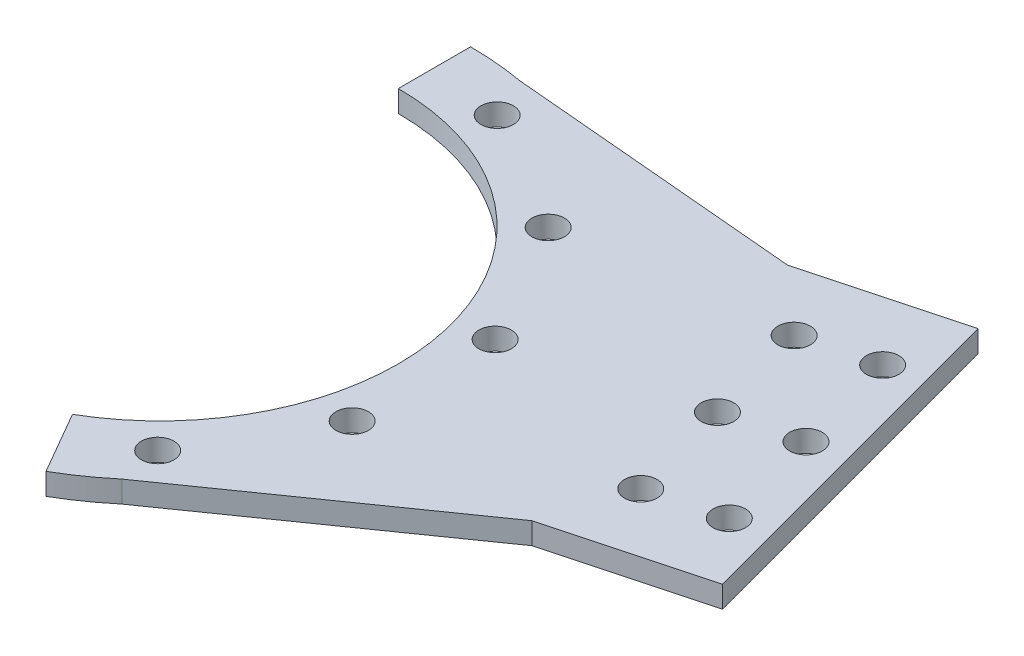
ISO-10303-21;
HEADER;
FILE_DESCRIPTION(('STEP AP214'),'2;1');
FILE_NAME('part.step','',(''),(''),'','','');
FILE_SCHEMA(('AUTOMOTIVE_DESIGN { 1 0 10303 214 1 1 1 1 }'));
ENDSEC;
DATA;
#1=APPLICATION_CONTEXT('core data for automotive mechanical design processes');
#2=APPLICATION_PROTOCOL_DEFINITION('international standard','automotive_design',2000,#1);
#3=PRODUCT_CONTEXT('',#1,'mechanical');
#4=PRODUCT('Part','Part','',(#3));
#5=PRODUCT_RELATED_PRODUCT_CATEGORY('part','',(#4));
#6=PRODUCT_DEFINITION_FORMATION('','',#4);
#7=PRODUCT_DEFINITION_CONTEXT('part definition',#1,'design');
#8=PRODUCT_DEFINITION('design','',#6,#7);
#9=PRODUCT_DEFINITION_SHAPE('','',#8);
#10=(LENGTH_UNIT() NAMED_UNIT(*) SI_UNIT(.MILLI.,.METRE.));
#11=(NAMED_UNIT(*) PLANE_ANGLE_UNIT() SI_UNIT($,.RADIAN.));
#12=(NAMED_UNIT(*) SI_UNIT($,.STERADIAN.) SOLID_ANGLE_UNIT());
#13=UNCERTAINTY_MEASURE_WITH_UNIT(LENGTH_MEASURE(1.E-05),#10,'distance_accuracy_value','');
#14=(GEOMETRIC_REPRESENTATION_CONTEXT(3) GLOBAL_UNCERTAINTY_ASSIGNED_CONTEXT((#13)) GLOBAL_UNIT_ASSIGNED_CONTEXT((#10,
#11,#12)) REPRESENTATION_CONTEXT('',''));
#15=CARTESIAN_POINT('',(0.,0.,0.));
#16=DIRECTION('',(0.,0.,1.));
#17=DIRECTION('',(1.,0.,0.));
#18=AXIS2_PLACEMENT_3D('',#15,#16,#17);
#19=CARTESIAN_POINT('',(0.,1.5,0.));
#20=DIRECTION('',(0.,-1.,0.));
#21=DIRECTION('',(0.,0.,-1.));
#22=AXIS2_PLACEMENT_3D('',#19,#20,#21);
#23=CYLINDRICAL_SURFACE('',#22,43.);
#24=DIRECTION('',(0.,-1.,0.));
#25=VECTOR('',#24,1.);
#26=CARTESIAN_POINT('',(27.67036701415,1.5,32.9142946043545));
#27=LINE('',#26,#25);
#28=CARTESIAN_POINT('',(27.6703670141498,1.5,32.9142946043546));
#29=VERTEX_POINT('',#28);
#30=CARTESIAN_POINT('',(27.6703670141498,-1.5,32.9142946043546));
#31=VERTEX_POINT('',#30);
#32=EDGE_CURVE('E47',#29,#31,#27,.T.);
#33=ORIENTED_EDGE('',*,*,#32,.F.);
#34=CARTESIAN_POINT('',(0.,1.5,0.));
#35=DIRECTION('',(0.,1.,0.));
#36=DIRECTION('',(0.,0.,-1.));
#37=AXIS2_PLACEMENT_3D('',#34,#35,#36);
#38=CIRCLE('',#37,43.);
#39=CARTESIAN_POINT('',(21.4999999999998,1.5,37.239092362731));
#40=VERTEX_POINT('',#39);
#41=EDGE_CURVE('E166',#40,#29,#38,.T.);
#42=ORIENTED_EDGE('',*,*,#41,.F.);
#43=DIRECTION('',(0.,-1.,0.));
#44=VECTOR('',#43,1.);
#45=CARTESIAN_POINT('',(21.4999999999998,1.5,37.239092362731));
#46=LINE('',#45,#44);
#47=CARTESIAN_POINT('',(21.4999999999998,-1.5,37.239092362731));
#48=VERTEX_POINT('',#47);
#49=EDGE_CURVE('E175',#40,#48,#46,.T.);
#50=ORIENTED_EDGE('',*,*,#49,.T.);
#51=CARTESIAN_POINT('',(0.,-1.5,0.));
#52=DIRECTION('',(0.,1.,0.));
#53=DIRECTION('',(0.,0.,-1.));
#54=AXIS2_PLACEMENT_3D('',#51,#52,#53);
#55=CIRCLE('',#54,43.);
#56=EDGE_CURVE('E52',#48,#31,#55,.T.);
#57=ORIENTED_EDGE('',*,*,#56,.T.);
#58=EDGE_LOOP('',(#33,#42,#50,#57));
#59=FACE_BOUND('',#58,.T.);
#60=ADVANCED_FACE('F32',(#59),#23,.T.);
#61=CARTESIAN_POINT('',(81.8126905781105,1.5,3.96026013922945));
#62=DIRECTION('',(-0.258819045102535,0.,-0.965925826289064));
#63=DIRECTION('',(-0.965925826289065,0.,0.258819045102535));
#64=AXIS2_PLACEMENT_3D('',#61,#62,#63);
#65=PLANE('',#64);
#66=DIRECTION('',(0.,-1.,0.));
#67=VECTOR('',#66,1.);
#68=CARTESIAN_POINT('',(61.0383844340775,1.5,9.52671869384002));
#69=LINE('',#68,#67);
#70=CARTESIAN_POINT('',(61.0383844340775,1.5,9.52671869384034));
#71=VERTEX_POINT('',#70);
#72=CARTESIAN_POINT('',(61.0383844340775,-1.5,9.52671869384002));
#73=VERTEX_POINT('',#72);
#74=EDGE_CURVE('E123',#71,#73,#69,.T.);
#75=ORIENTED_EDGE('',*,*,#74,.T.);
#76=DIRECTION('',(0.965925826289065,0.,-0.258819045102535));
#77=VECTOR('',#76,1.);
#78=CARTESIAN_POINT('',(81.8126905781105,-1.5,3.96026013922945));
#79=LINE('',#78,#77);
#80=CARTESIAN_POINT('',(81.8126905781105,-1.5,3.96026013922945));
#81=VERTEX_POINT('',#80);
#82=EDGE_CURVE('E109',#73,#81,#79,.T.);
#83=ORIENTED_EDGE('',*,*,#82,.T.);
#84=DIRECTION('',(0.,-1.,0.));
#85=VECTOR('',#84,1.);
#86=CARTESIAN_POINT('',(81.8126905781105,1.5,3.96026013922945));
#87=LINE('',#86,#85);
#88=CARTESIAN_POINT('',(81.8126905781105,1.5,3.96026013922945));
#89=VERTEX_POINT('',#88);
#90=EDGE_CURVE('E158',#89,#81,#87,.T.);
#91=ORIENTED_EDGE('',*,*,#90,.F.);
#92=DIRECTION('',(0.965925826289065,0.,-0.258819045102535));
#93=VECTOR('',#92,1.);
#94=CARTESIAN_POINT('',(81.8126905781105,1.5,3.96026013922945));
#95=LINE('',#94,#93);
#96=EDGE_CURVE('E125',#71,#89,#95,.T.);
#97=ORIENTED_EDGE('',*,*,#96,.F.);
#98=EDGE_LOOP('',(#75,#83,#91,#97));
#99=FACE_BOUND('',#98,.T.);
#100=ADVANCED_FACE('F124',(#99),#65,.F.);
#101=DIRECTION('',(0.,-1.,0.));
#102=VECTOR('',#101,1.);
#103=CARTESIAN_POINT('',(7.50609346411504,1.5,-42.3397987820912));
#104=LINE('',#103,#102);
#105=CARTESIAN_POINT('',(7.50609346411481,-1.5,-42.3397987820912));
#106=VERTEX_POINT('',#105);
#107=CARTESIAN_POINT('',(7.50609346411481,1.5,-42.3397987820912));
#108=VERTEX_POINT('',#107);
#109=EDGE_CURVE('E149',#106,#108,#104,.F.);
#110=ORIENTED_EDGE('',*,*,#109,.F.);
#111=CARTESIAN_POINT('',(0.,-1.5,-43.));
#112=VERTEX_POINT('',#111);
#113=EDGE_CURVE('E165',#106,#112,#55,.T.);
#114=ORIENTED_EDGE('',*,*,#113,.T.);
#115=DIRECTION('',(0.,-1.,0.));
#116=VECTOR('',#115,1.);
#117=CARTESIAN_POINT('',(0.,1.5,-43.));
#118=LINE('',#117,#116);
#119=CARTESIAN_POINT('',(0.,1.5,-43.));
#120=VERTEX_POINT('',#119);
#121=EDGE_CURVE('E11',#120,#112,#118,.T.);
#122=ORIENTED_EDGE('',*,*,#121,.F.);
#123=EDGE_CURVE('E169',#108,#120,#38,.T.);
#124=ORIENTED_EDGE('',*,*,#123,.F.);
#125=EDGE_LOOP('',(#110,#114,#122,#124));
#126=FACE_BOUND('',#125,.T.);
#127=ADVANCED_FACE('F34',(#126),#23,.T.);
#128=CARTESIAN_POINT('',(68.8717383229838,1.5,-44.3360311752238));
#129=DIRECTION('',(0.258819045102535,0.,0.965925826289064));
#130=DIRECTION('',(0.965925826289065,0.,-0.258819045102535));
#131=AXIS2_PLACEMENT_3D('',#128,#129,#130);
#132=PLANE('',#131);
#133=DIRECTION('',(0.,-1.,0.));
#134=VECTOR('',#133,1.);
#135=CARTESIAN_POINT('',(48.0974321789512,1.5,-38.769572620613));
#136=LINE('',#135,#134);
#137=CARTESIAN_POINT('',(48.0974321789512,1.5,-38.769572620613));
#138=VERTEX_POINT('',#137);
#139=CARTESIAN_POINT('',(48.0974321789512,-1.5,-38.769572620613));
#140=VERTEX_POINT('',#139);
#141=EDGE_CURVE('E144',#138,#140,#136,.T.);
#142=ORIENTED_EDGE('',*,*,#141,.F.);
#143=DIRECTION('',(-0.965925826289065,0.,0.258819045102535));
#144=VECTOR('',#143,1.);
#145=CARTESIAN_POINT('',(68.8717383229838,1.5,-44.3360311752238));
#146=LINE('',#145,#144);
#147=CARTESIAN_POINT('',(68.8717383229838,1.5,-44.3360311752238));
#148=VERTEX_POINT('',#147);
#149=EDGE_CURVE('E154',#148,#138,#146,.T.);
#150=ORIENTED_EDGE('',*,*,#149,.F.);
#151=DIRECTION('',(0.,-1.,0.));
#152=VECTOR('',#151,1.);
#153=CARTESIAN_POINT('',(68.8717383229838,1.5,-44.3360311752238));
#154=LINE('',#153,#152);
#155=CARTESIAN_POINT('',(68.8717383229838,-1.5,-44.3360311752238));
#156=VERTEX_POINT('',#155);
#157=EDGE_CURVE('E162',#148,#156,#154,.T.);
#158=ORIENTED_EDGE('',*,*,#157,.T.);
#159=DIRECTION('',(-0.965925826289065,0.,0.258819045102535));
#160=VECTOR('',#159,1.);
#161=CARTESIAN_POINT('',(68.8717383229838,-1.5,-44.3360311752238));
#162=LINE('',#161,#160);
#163=EDGE_CURVE('E120',#156,#140,#162,.T.);
#164=ORIENTED_EDGE('',*,*,#163,.T.);
#165=EDGE_LOOP('',(#142,#150,#158,#164));
#166=FACE_BOUND('',#165,.T.);
#167=ADVANCED_FACE('F212',(#166),#132,.F.);
#168=CARTESIAN_POINT('',(0.,1.5,-33.));
#169=DIRECTION('',(1.,0.,0.));
#170=DIRECTION('',(0.,0.,-1.));
#171=AXIS2_PLACEMENT_3D('',#168,#169,#170);
#172=PLANE('',#171);
#173=DIRECTION('',(0.,0.,1.));
#174=VECTOR('',#173,1.);
#175=CARTESIAN_POINT('',(0.,-1.5,-33.));
#176=LINE('',#175,#174);
#177=CARTESIAN_POINT('',(0.,-1.5,-33.));
#178=VERTEX_POINT('',#177);
#179=EDGE_CURVE('E177',#112,#178,#176,.T.);
#180=ORIENTED_EDGE('',*,*,#179,.T.);
#181=DIRECTION('',(0.,-1.,0.));
#182=VECTOR('',#181,1.);
#183=CARTESIAN_POINT('',(0.,1.5,-33.));
#184=LINE('',#183,#182);
#185=CARTESIAN_POINT('',(0.,1.5,-33.));
#186=VERTEX_POINT('',#185);
#187=EDGE_CURVE('E40',#186,#178,#184,.T.);
#188=ORIENTED_EDGE('',*,*,#187,.F.);
#189=DIRECTION('',(0.,0.,1.));
#190=VECTOR('',#189,1.);
#191=CARTESIAN_POINT('',(0.,1.5,-33.));
#192=LINE('',#191,#190);
#193=EDGE_CURVE('E168',#120,#186,#192,.T.);
#194=ORIENTED_EDGE('',*,*,#193,.F.);
#195=ORIENTED_EDGE('',*,*,#121,.T.);
#196=EDGE_LOOP('',(#180,#188,#194,#195));
#197=FACE_BOUND('',#196,.T.);
#198=ADVANCED_FACE('F205',(#197),#172,.F.);
#199=CARTESIAN_POINT('',(0.,1.5,0.));
#200=DIRECTION('',(0.,-1.,0.));
#201=DIRECTION('',(0.,0.,-1.));
#202=AXIS2_PLACEMENT_3D('',#199,#200,#201);
#203=CYLINDRICAL_SURFACE('',#202,33.);
#204=CARTESIAN_POINT('',(0.,-1.5,0.));
#205=DIRECTION('',(0.,-1.,0.));
#206=DIRECTION('',(0.,0.,-1.));
#207=AXIS2_PLACEMENT_3D('',#204,#205,#206);
#208=CIRCLE('',#207,33.);
#209=CARTESIAN_POINT('',(16.4999999999998,-1.5,28.5788383248866));
#210=VERTEX_POINT('',#209);
#211=EDGE_CURVE('E179',#178,#210,#208,.T.);
#212=ORIENTED_EDGE('',*,*,#211,.T.);
#213=DIRECTION('',(0.,-1.,0.));
#214=VECTOR('',#213,1.);
#215=CARTESIAN_POINT('',(16.4999999999998,1.5,28.5788383248866));
#216=LINE('',#215,#214);
#217=CARTESIAN_POINT('',(16.4999999999998,1.5,28.5788383248866));
#218=VERTEX_POINT('',#217);
#219=EDGE_CURVE('E184',#218,#210,#216,.T.);
#220=ORIENTED_EDGE('',*,*,#219,.F.);
#221=CARTESIAN_POINT('',(0.,1.5,0.));
#222=DIRECTION('',(0.,-1.,0.));
#223=DIRECTION('',(0.,0.,-1.));
#224=AXIS2_PLACEMENT_3D('',#221,#222,#223);
#225=CIRCLE('',#224,33.);
#226=EDGE_CURVE('E171',#186,#218,#225,.T.);
#227=ORIENTED_EDGE('',*,*,#226,.F.);
#228=ORIENTED_EDGE('',*,*,#187,.T.);
#229=EDGE_LOOP('',(#212,#220,#227,#228));
#230=FACE_BOUND('',#229,.T.);
#231=ADVANCED_FACE('F191',(#230),#203,.F.);
#232=CARTESIAN_POINT('',(16.4999999999998,1.5,28.5788383248866));
#233=DIRECTION('',(0.866025403784441,0.,-0.499999999999995));
#234=DIRECTION('',(-0.499999999999995,0.,-0.866025403784441));
#235=AXIS2_PLACEMENT_3D('',#232,#233,#234);
#236=PLANE('',#235);
#237=DIRECTION('',(0.499999999999995,0.,0.866025403784441));
#238=VECTOR('',#237,1.);
#239=CARTESIAN_POINT('',(16.4999999999998,-1.5,28.5788383248866));
#240=LINE('',#239,#238);
#241=EDGE_CURVE('E181',#210,#48,#240,.T.);
#242=ORIENTED_EDGE('',*,*,#241,.T.);
#243=ORIENTED_EDGE('',*,*,#49,.F.);
#244=DIRECTION('',(0.499999999999995,0.,0.866025403784441));
#245=VECTOR('',#244,1.);
#246=CARTESIAN_POINT('',(16.4999999999998,1.5,28.5788383248866));
#247=LINE('',#246,#245);
#248=EDGE_CURVE('E173',#218,#40,#247,.T.);
#249=ORIENTED_EDGE('',*,*,#248,.F.);
#250=ORIENTED_EDGE('',*,*,#219,.T.);
#251=EDGE_LOOP('',(#242,#243,#249,#250));
#252=FACE_BOUND('',#251,.T.);
#253=ADVANCED_FACE('F200',(#252),#236,.F.);
#254=CARTESIAN_POINT('',(0.,1.5,0.));
#255=DIRECTION('',(0.,-1.,0.));
#256=DIRECTION('',(0.,0.,-1.));
#257=AXIS2_PLACEMENT_3D('',#254,#255,#256);
#258=PLANE('',#257);
#259=CARTESIAN_POINT('',(74.3948709956399,1.5,-4.40490289814852));
#260=DIRECTION('',(0.,-1.,0.));
#261=DIRECTION('',(0.,0.,-1.));
#262=AXIS2_PLACEMENT_3D('',#259,#260,#261);
#263=CIRCLE('',#262,2.25);
#264=CARTESIAN_POINT('',(74.3948709956399,1.5,-6.65490289814852));
#265=VERTEX_POINT('',#264);
#266=EDGE_CURVE('E294',#265,#265,#263,.T.);
#267=ORIENTED_EDGE('',*,*,#266,.T.);
#268=EDGE_LOOP('',(#267));
#269=FACE_BOUND('',#268,.T.);
#270=CARTESIAN_POINT('',(64.7356127327492,1.5,-1.81671244712317));
#271=DIRECTION('',(0.,-1.,0.));
#272=DIRECTION('',(0.,0.,-1.));
#273=AXIS2_PLACEMENT_3D('',#270,#271,#272);
#274=CIRCLE('',#273,2.25);
#275=CARTESIAN_POINT('',(64.7356127327492,1.5,-4.06671244712317));
#276=VERTEX_POINT('',#275);
#277=EDGE_CURVE('E297',#276,#276,#274,.T.);
#278=ORIENTED_EDGE('',*,*,#277,.T.);
#279=EDGE_LOOP('',(#278));
#280=FACE_BOUND('',#279,.T.);
#281=CARTESIAN_POINT('',(60.8533270562112,1.5,-16.3055998414591));
#282=DIRECTION('',(0.,-1.,0.));
#283=DIRECTION('',(0.,0.,-1.));
#284=AXIS2_PLACEMENT_3D('',#281,#282,#283);
#285=CIRCLE('',#284,2.25);
#286=CARTESIAN_POINT('',(60.8533270562112,1.5,-18.5555998414591));
#287=VERTEX_POINT('',#286);
#288=EDGE_CURVE('E317',#287,#287,#285,.T.);
#289=ORIENTED_EDGE('',*,*,#288,.T.);
#290=EDGE_LOOP('',(#289));
#291=FACE_BOUND('',#290,.T.);
#292=CARTESIAN_POINT('',(66.6302996425638,1.5,-33.3826776868205));
#293=DIRECTION('',(0.,-1.,0.));
#294=DIRECTION('',(0.,0.,-1.));
#295=AXIS2_PLACEMENT_3D('',#292,#293,#294);
#296=CIRCLE('',#295,2.25);
#297=CARTESIAN_POINT('',(66.6302996425638,1.5,-35.6326776868205));
#298=VERTEX_POINT('',#297);
#299=EDGE_CURVE('E314',#298,#298,#296,.T.);
#300=ORIENTED_EDGE('',*,*,#299,.T.);
#301=EDGE_LOOP('',(#300));
#302=FACE_BOUND('',#301,.T.);
#303=CARTESIAN_POINT('',(56.9710413796732,1.5,-30.7944872357951));
#304=DIRECTION('',(0.,-1.,0.));
#305=DIRECTION('',(0.,0.,-1.));
#306=AXIS2_PLACEMENT_3D('',#303,#304,#305);
#307=CIRCLE('',#306,2.25);
#308=CARTESIAN_POINT('',(56.9710413796732,1.5,-33.0444872357951));
#309=VERTEX_POINT('',#308);
#310=EDGE_CURVE('E309',#309,#309,#307,.T.);
#311=ORIENTED_EDGE('',*,*,#310,.T.);
#312=EDGE_LOOP('',(#311));
#313=FACE_BOUND('',#312,.T.);
#314=CARTESIAN_POINT('',(70.5125853191018,1.5,-18.8937902924845));
#315=DIRECTION('',(0.,-1.,0.));
#316=DIRECTION('',(0.,0.,-1.));
#317=AXIS2_PLACEMENT_3D('',#314,#315,#316);
#318=CIRCLE('',#317,2.25);
#319=CARTESIAN_POINT('',(70.5125853191018,1.5,-21.1437902924845));
#320=VERTEX_POINT('',#319);
#321=EDGE_CURVE('E323',#320,#320,#318,.T.);
#322=ORIENTED_EDGE('',*,*,#321,.T.);
#323=EDGE_LOOP('',(#322));
#324=FACE_BOUND('',#323,.T.);
#325=CARTESIAN_POINT('',(36.6520508829246,1.5,10.0313092901925));
#326=DIRECTION('',(0.,-1.,0.));
#327=DIRECTION('',(0.,0.,-1.));
#328=AXIS2_PLACEMENT_3D('',#325,#326,#327);
#329=CIRCLE('',#328,2.25);
#330=CARTESIAN_POINT('',(36.6520508829246,1.5,7.78130929019255));
#331=VERTEX_POINT('',#330);
#332=EDGE_CURVE('E347',#331,#331,#329,.T.);
#333=ORIENTED_EDGE('',*,*,#332,.T.);
#334=EDGE_LOOP('',(#333));
#335=FACE_BOUND('',#334,.T.);
#336=CARTESIAN_POINT('',(26.7259525203163,1.5,27.0133941199879));
#337=DIRECTION('',(0.,-1.,0.));
#338=DIRECTION('',(0.,0.,-1.));
#339=AXIS2_PLACEMENT_3D('',#336,#337,#338);
#340=CIRCLE('',#339,2.25);
#341=CARTESIAN_POINT('',(26.7259525203163,1.5,24.7633941199879));
#342=VERTEX_POINT('',#341);
#343=EDGE_CURVE('E344',#342,#342,#340,.T.);
#344=ORIENTED_EDGE('',*,*,#343,.T.);
#345=EDGE_LOOP('',(#344));
#346=FACE_BOUND('',#345,.T.);
#347=CARTESIAN_POINT('',(27.0133941199878,1.5,-26.7259525203164));
#348=DIRECTION('',(0.,-1.,0.));
#349=DIRECTION('',(0.,0.,-1.));
#350=AXIS2_PLACEMENT_3D('',#347,#348,#349);
#351=CIRCLE('',#350,2.25);
#352=CARTESIAN_POINT('',(27.0133941199878,1.5,-28.9759525203164));
#353=VERTEX_POINT('',#352);
#354=EDGE_CURVE('E341',#353,#353,#351,.T.);
#355=ORIENTED_EDGE('',*,*,#354,.T.);
#356=EDGE_LOOP('',(#355));
#357=FACE_BOUND('',#356,.T.);
#358=CARTESIAN_POINT('',(10.0313092901924,1.5,-36.6520508829247));
#359=DIRECTION('',(0.,-1.,0.));
#360=DIRECTION('',(0.,0.,-1.));
#361=AXIS2_PLACEMENT_3D('',#358,#359,#360);
#362=CIRCLE('',#361,2.25);
#363=CARTESIAN_POINT('',(10.0313092901924,1.5,-38.9020508829247));
#364=VERTEX_POINT('',#363);
#365=EDGE_CURVE('E330',#364,#364,#362,.T.);
#366=ORIENTED_EDGE('',*,*,#365,.T.);
#367=EDGE_LOOP('',(#366));
#368=FACE_BOUND('',#367,.T.);
#369=CARTESIAN_POINT('',(36.7572618105089,1.5,-9.63865676293677));
#370=DIRECTION('',(0.,-1.,0.));
#371=DIRECTION('',(0.,0.,-1.));
#372=AXIS2_PLACEMENT_3D('',#369,#370,#371);
#373=CIRCLE('',#372,2.25);
#374=CARTESIAN_POINT('',(36.7572618105089,1.5,-11.8886567629368));
#375=VERTEX_POINT('',#374);
#376=EDGE_CURVE('E132',#375,#375,#373,.T.);
#377=ORIENTED_EDGE('',*,*,#376,.T.);
#378=EDGE_LOOP('',(#377));
#379=FACE_BOUND('',#378,.T.);
#380=ORIENTED_EDGE('',*,*,#41,.T.);
#381=DIRECTION('',(0.818886309568862,0.,-0.573955757877461));
#382=VECTOR('',#381,1.);
#383=CARTESIAN_POINT('',(21.5000000000005,1.5,37.2390923627306));
#384=LINE('',#383,#382);
#385=EDGE_CURVE('E129',#29,#71,#384,.T.);
#386=ORIENTED_EDGE('',*,*,#385,.T.);
#387=ORIENTED_EDGE('',*,*,#96,.T.);
#388=DIRECTION('',(-0.258819045102534,0.,-0.965925826289065));
#389=VECTOR('',#388,1.);
#390=CARTESIAN_POINT('',(68.8717383229838,1.5,-44.3360311752238));
#391=LINE('',#390,#389);
#392=EDGE_CURVE('E119',#89,#148,#391,.T.);
#393=ORIENTED_EDGE('',*,*,#392,.T.);
#394=ORIENTED_EDGE('',*,*,#149,.T.);
#395=DIRECTION('',(-0.996154225836654,0.,-0.0876171121857866));
#396=VECTOR('',#395,1.);
#397=CARTESIAN_POINT('',(0.,1.5,-43.));
#398=LINE('',#397,#396);
#399=EDGE_CURVE('E141',#138,#108,#398,.T.);
#400=ORIENTED_EDGE('',*,*,#399,.T.);
#401=ORIENTED_EDGE('',*,*,#123,.T.);
#402=ORIENTED_EDGE('',*,*,#193,.T.);
#403=ORIENTED_EDGE('',*,*,#226,.T.);
#404=ORIENTED_EDGE('',*,*,#248,.T.);
#405=EDGE_LOOP('',(#380,#386,#387,#393,#394,#400,#401,#402,#403,#404));
#406=FACE_BOUND('',#405,.T.);
#407=ADVANCED_FACE('F203',(#269,#280,#291,#302,#313,#324,#335,#346,#357,#368,#379,#406),#258,.F.);
#408=CARTESIAN_POINT('',(0.,-1.5,0.));
#409=DIRECTION('',(0.,-1.,0.));
#410=DIRECTION('',(0.,0.,-1.));
#411=AXIS2_PLACEMENT_3D('',#408,#409,#410);
#412=PLANE('',#411);
#413=CARTESIAN_POINT('',(74.3948709956399,-1.5,-4.40490289814852));
#414=DIRECTION('',(0.,1.,0.));
#415=DIRECTION('',(0.,0.,1.));
#416=AXIS2_PLACEMENT_3D('',#413,#414,#415);
#417=CIRCLE('',#416,2.25);
#418=CARTESIAN_POINT('',(74.3948709956399,-1.5,-2.15490289814853));
#419=VERTEX_POINT('',#418);
#420=EDGE_CURVE('E291',#419,#419,#417,.T.);
#421=ORIENTED_EDGE('',*,*,#420,.T.);
#422=EDGE_LOOP('',(#421));
#423=FACE_BOUND('',#422,.T.);
#424=CARTESIAN_POINT('',(64.7356127327492,-1.5,-1.81671244712317));
#425=DIRECTION('',(0.,1.,0.));
#426=DIRECTION('',(0.,0.,1.));
#427=AXIS2_PLACEMENT_3D('',#424,#425,#426);
#428=CIRCLE('',#427,2.25);
#429=CARTESIAN_POINT('',(64.7356127327492,-1.5,0.433287552876823));
#430=VERTEX_POINT('',#429);
#431=EDGE_CURVE('E550',#430,#430,#428,.T.);
#432=ORIENTED_EDGE('',*,*,#431,.T.);
#433=EDGE_LOOP('',(#432));
#434=FACE_BOUND('',#433,.T.);
#435=CARTESIAN_POINT('',(60.8533270562112,-1.5,-16.3055998414591));
#436=DIRECTION('',(0.,1.,0.));
#437=DIRECTION('',(0.,0.,1.));
#438=AXIS2_PLACEMENT_3D('',#435,#436,#437);
#439=CIRCLE('',#438,2.25);
#440=CARTESIAN_POINT('',(60.8533270562112,-1.5,-14.0555998414591));
#441=VERTEX_POINT('',#440);
#442=EDGE_CURVE('E306',#441,#441,#439,.T.);
#443=ORIENTED_EDGE('',*,*,#442,.T.);
#444=EDGE_LOOP('',(#443));
#445=FACE_BOUND('',#444,.T.);
#446=CARTESIAN_POINT('',(66.6302996425638,-1.5,-33.3826776868205));
#447=DIRECTION('',(0.,1.,0.));
#448=DIRECTION('',(0.,0.,1.));
#449=AXIS2_PLACEMENT_3D('',#446,#447,#448);
#450=CIRCLE('',#449,2.25);
#451=CARTESIAN_POINT('',(66.6302996425638,-1.5,-31.1326776868205));
#452=VERTEX_POINT('',#451);
#453=EDGE_CURVE('E300',#452,#452,#450,.T.);
#454=ORIENTED_EDGE('',*,*,#453,.T.);
#455=EDGE_LOOP('',(#454));
#456=FACE_BOUND('',#455,.T.);
#457=CARTESIAN_POINT('',(56.9710413796732,-1.5,-30.7944872357951));
#458=DIRECTION('',(0.,1.,0.));
#459=DIRECTION('',(0.,0.,1.));
#460=AXIS2_PLACEMENT_3D('',#457,#458,#459);
#461=CIRCLE('',#460,2.25);
#462=CARTESIAN_POINT('',(56.9710413796732,-1.5,-28.5444872357951));
#463=VERTEX_POINT('',#462);
#464=EDGE_CURVE('E296',#463,#463,#461,.T.);
#465=ORIENTED_EDGE('',*,*,#464,.T.);
#466=EDGE_LOOP('',(#465));
#467=FACE_BOUND('',#466,.T.);
#468=CARTESIAN_POINT('',(70.5125853191018,-1.5,-18.8937902924845));
#469=DIRECTION('',(0.,1.,0.));
#470=DIRECTION('',(0.,0.,1.));
#471=AXIS2_PLACEMENT_3D('',#468,#469,#470);
#472=CIRCLE('',#471,2.25);
#473=CARTESIAN_POINT('',(70.5125853191018,-1.5,-16.6437902924845));
#474=VERTEX_POINT('',#473);
#475=EDGE_CURVE('E320',#474,#474,#472,.T.);
#476=ORIENTED_EDGE('',*,*,#475,.T.);
#477=EDGE_LOOP('',(#476));
#478=FACE_BOUND('',#477,.T.);
#479=CARTESIAN_POINT('',(36.6520508829246,-1.5,10.0313092901925));
#480=DIRECTION('',(0.,1.,0.));
#481=DIRECTION('',(-0.500000000000001,0.,0.866025403784438));
#482=AXIS2_PLACEMENT_3D('',#479,#480,#481);
#483=CIRCLE('',#482,2.25);
#484=CARTESIAN_POINT('',(35.5270508829246,-1.5,11.9798664487075));
#485=VERTEX_POINT('',#484);
#486=EDGE_CURVE('E327',#485,#485,#483,.T.);
#487=ORIENTED_EDGE('',*,*,#486,.T.);
#488=EDGE_LOOP('',(#487));
#489=FACE_BOUND('',#488,.T.);
#490=CARTESIAN_POINT('',(26.7259525203163,-1.5,27.0133941199879));
#491=DIRECTION('',(0.,1.,0.));
#492=DIRECTION('',(-0.86602540378444,0.,0.499999999999998));
#493=AXIS2_PLACEMENT_3D('',#490,#491,#492);
#494=CIRCLE('',#493,2.25);
#495=CARTESIAN_POINT('',(24.7773953618013,-1.5,28.1383941199879));
#496=VERTEX_POINT('',#495);
#497=EDGE_CURVE('E331',#496,#496,#494,.T.);
#498=ORIENTED_EDGE('',*,*,#497,.T.);
#499=EDGE_LOOP('',(#498));
#500=FACE_BOUND('',#499,.T.);
#501=CARTESIAN_POINT('',(27.0133941199878,-1.5,-26.7259525203164));
#502=DIRECTION('',(0.,1.,0.));
#503=DIRECTION('',(0.500000000000001,0.,0.866025403784438));
#504=AXIS2_PLACEMENT_3D('',#501,#502,#503);
#505=CIRCLE('',#504,2.25);
#506=CARTESIAN_POINT('',(28.1383941199878,-1.5,-24.7773953618014));
#507=VERTEX_POINT('',#506);
#508=EDGE_CURVE('E334',#507,#507,#505,.T.);
#509=ORIENTED_EDGE('',*,*,#508,.T.);
#510=EDGE_LOOP('',(#509));
#511=FACE_BOUND('',#510,.T.);
#512=CARTESIAN_POINT('',(10.0313092901924,-1.5,-36.6520508829247));
#513=DIRECTION('',(0.,1.,0.));
#514=DIRECTION('',(0.86602540378444,0.,0.499999999999998));
#515=AXIS2_PLACEMENT_3D('',#512,#513,#514);
#516=CIRCLE('',#515,2.25);
#517=CARTESIAN_POINT('',(11.9798664487074,-1.5,-35.5270508829247));
#518=VERTEX_POINT('',#517);
#519=EDGE_CURVE('E326',#518,#518,#516,.T.);
#520=ORIENTED_EDGE('',*,*,#519,.T.);
#521=EDGE_LOOP('',(#520));
#522=FACE_BOUND('',#521,.T.);
#523=CARTESIAN_POINT('',(36.7572618105089,-1.5,-9.63865676293677));
#524=DIRECTION('',(0.,1.,0.));
#525=DIRECTION('',(0.,0.,1.));
#526=AXIS2_PLACEMENT_3D('',#523,#524,#525);
#527=CIRCLE('',#526,2.25);
#528=CARTESIAN_POINT('',(36.7572618105089,-1.5,-7.38865676293677));
#529=VERTEX_POINT('',#528);
#530=EDGE_CURVE('E136',#529,#529,#527,.T.);
#531=ORIENTED_EDGE('',*,*,#530,.T.);
#532=EDGE_LOOP('',(#531));
#533=FACE_BOUND('',#532,.T.);
#534=DIRECTION('',(0.818886309568862,0.,-0.573955757877461));
#535=VECTOR('',#534,1.);
#536=CARTESIAN_POINT('',(21.5000000000005,-1.5,37.2390923627306));
#537=LINE('',#536,#535);
#538=EDGE_CURVE('E113',#31,#73,#537,.T.);
#539=ORIENTED_EDGE('',*,*,#538,.F.);
#540=ORIENTED_EDGE('',*,*,#56,.F.);
#541=ORIENTED_EDGE('',*,*,#241,.F.);
#542=ORIENTED_EDGE('',*,*,#211,.F.);
#543=ORIENTED_EDGE('',*,*,#179,.F.);
#544=ORIENTED_EDGE('',*,*,#113,.F.);
#545=DIRECTION('',(-0.996154225836654,0.,-0.0876171121857866));
#546=VECTOR('',#545,1.);
#547=CARTESIAN_POINT('',(0.,-1.5,-43.));
#548=LINE('',#547,#546);
#549=EDGE_CURVE('E140',#140,#106,#548,.T.);
#550=ORIENTED_EDGE('',*,*,#549,.F.);
#551=ORIENTED_EDGE('',*,*,#163,.F.);
#552=DIRECTION('',(-0.258819045102534,0.,-0.965925826289065));
#553=VECTOR('',#552,1.);
#554=CARTESIAN_POINT('',(68.8717383229838,-1.5,-44.3360311752238));
#555=LINE('',#554,#553);
#556=EDGE_CURVE('E115',#81,#156,#555,.T.);
#557=ORIENTED_EDGE('',*,*,#556,.F.);
#558=ORIENTED_EDGE('',*,*,#82,.F.);
#559=EDGE_LOOP('',(#539,#540,#541,#542,#543,#544,#550,#551,#557,#558));
#560=FACE_BOUND('',#559,.T.);
#561=ADVANCED_FACE('F111',(#423,#434,#445,#456,#467,#478,#489,#500,#511,#522,#533,#560),#412,.T.);
#562=CARTESIAN_POINT('',(68.8717383229838,1.5,-44.3360311752238));
#563=DIRECTION('',(-0.965925826289065,0.,0.258819045102534));
#564=DIRECTION('',(0.258819045102534,0.,0.965925826289065));
#565=AXIS2_PLACEMENT_3D('',#562,#563,#564);
#566=PLANE('',#565);
#567=ORIENTED_EDGE('',*,*,#556,.T.);
#568=ORIENTED_EDGE('',*,*,#157,.F.);
#569=ORIENTED_EDGE('',*,*,#392,.F.);
#570=ORIENTED_EDGE('',*,*,#90,.T.);
#571=EDGE_LOOP('',(#567,#568,#569,#570));
#572=FACE_BOUND('',#571,.T.);
#573=ADVANCED_FACE('F216',(#572),#566,.F.);
#574=CARTESIAN_POINT('',(0.,1.5,-43.));
#575=DIRECTION('',(-0.0876171121857866,0.,0.996154225836654));
#576=DIRECTION('',(0.996154225836654,0.,0.0876171121857866));
#577=AXIS2_PLACEMENT_3D('',#574,#575,#576);
#578=PLANE('',#577);
#579=ORIENTED_EDGE('',*,*,#549,.T.);
#580=ORIENTED_EDGE('',*,*,#109,.T.);
#581=ORIENTED_EDGE('',*,*,#399,.F.);
#582=ORIENTED_EDGE('',*,*,#141,.T.);
#583=EDGE_LOOP('',(#579,#580,#581,#582));
#584=FACE_BOUND('',#583,.T.);
#585=ADVANCED_FACE('F209',(#584),#578,.F.);
#586=CARTESIAN_POINT('',(21.5000000000005,1.5,37.2390923627306));
#587=DIRECTION('',(-0.573955757877461,0.,-0.818886309568862));
#588=DIRECTION('',(-0.818886309568862,0.,0.573955757877461));
#589=AXIS2_PLACEMENT_3D('',#586,#587,#588);
#590=PLANE('',#589);
#591=ORIENTED_EDGE('',*,*,#385,.F.);
#592=ORIENTED_EDGE('',*,*,#32,.T.);
#593=ORIENTED_EDGE('',*,*,#538,.T.);
#594=ORIENTED_EDGE('',*,*,#74,.F.);
#595=EDGE_LOOP('',(#591,#592,#593,#594));
#596=FACE_BOUND('',#595,.T.);
#597=ADVANCED_FACE('F131',(#596),#590,.F.);
#598=CARTESIAN_POINT('',(36.7572618105089,-1.5,-9.63865676293677));
#599=DIRECTION('',(0.,1.,0.));
#600=DIRECTION('',(0.,0.,1.));
#601=AXIS2_PLACEMENT_3D('',#598,#599,#600);
#602=CYLINDRICAL_SURFACE('',#601,2.25);
#603=ORIENTED_EDGE('',*,*,#530,.F.);
#604=EDGE_LOOP('',(#603));
#605=FACE_BOUND('',#604,.T.);
#606=ORIENTED_EDGE('',*,*,#376,.F.);
#607=EDGE_LOOP('',(#606));
#608=FACE_BOUND('',#607,.T.);
#609=ADVANCED_FACE('F243',(#605,#608),#602,.F.);
#610=CARTESIAN_POINT('',(10.0313092901924,-1.5,-36.6520508829247));
#611=DIRECTION('',(0.,1.,0.));
#612=DIRECTION('',(0.,0.,1.));
#613=AXIS2_PLACEMENT_3D('',#610,#611,#612);
#614=CYLINDRICAL_SURFACE('',#613,2.25);
#615=ORIENTED_EDGE('',*,*,#519,.F.);
#616=EDGE_LOOP('',(#615));
#617=FACE_BOUND('',#616,.T.);
#618=ORIENTED_EDGE('',*,*,#365,.F.);
#619=EDGE_LOOP('',(#618));
#620=FACE_BOUND('',#619,.T.);
#621=ADVANCED_FACE('F246',(#617,#620),#614,.F.);
#622=CARTESIAN_POINT('',(27.0133941199878,-1.5,-26.7259525203164));
#623=DIRECTION('',(0.,1.,0.));
#624=DIRECTION('',(0.,0.,1.));
#625=AXIS2_PLACEMENT_3D('',#622,#623,#624);
#626=CYLINDRICAL_SURFACE('',#625,2.25);
#627=ORIENTED_EDGE('',*,*,#508,.F.);
#628=EDGE_LOOP('',(#627));
#629=FACE_BOUND('',#628,.T.);
#630=ORIENTED_EDGE('',*,*,#354,.F.);
#631=EDGE_LOOP('',(#630));
#632=FACE_BOUND('',#631,.T.);
#633=ADVANCED_FACE('F250',(#629,#632),#626,.F.);
#634=CARTESIAN_POINT('',(26.7259525203163,-1.5,27.0133941199879));
#635=DIRECTION('',(0.,1.,0.));
#636=DIRECTION('',(0.,0.,1.));
#637=AXIS2_PLACEMENT_3D('',#634,#635,#636);
#638=CYLINDRICAL_SURFACE('',#637,2.25);
#639=ORIENTED_EDGE('',*,*,#497,.F.);
#640=EDGE_LOOP('',(#639));
#641=FACE_BOUND('',#640,.T.);
#642=ORIENTED_EDGE('',*,*,#343,.F.);
#643=EDGE_LOOP('',(#642));
#644=FACE_BOUND('',#643,.T.);
#645=ADVANCED_FACE('F254',(#641,#644),#638,.F.);
#646=CARTESIAN_POINT('',(36.6520508829246,-1.5,10.0313092901925));
#647=DIRECTION('',(0.,1.,0.));
#648=DIRECTION('',(0.,0.,1.));
#649=AXIS2_PLACEMENT_3D('',#646,#647,#648);
#650=CYLINDRICAL_SURFACE('',#649,2.25);
#651=ORIENTED_EDGE('',*,*,#486,.F.);
#652=EDGE_LOOP('',(#651));
#653=FACE_BOUND('',#652,.T.);
#654=ORIENTED_EDGE('',*,*,#332,.F.);
#655=EDGE_LOOP('',(#654));
#656=FACE_BOUND('',#655,.T.);
#657=ADVANCED_FACE('F258',(#653,#656),#650,.F.);
#658=CARTESIAN_POINT('',(70.5125853191018,-1.5,-18.8937902924845));
#659=DIRECTION('',(0.,1.,0.));
#660=DIRECTION('',(0.,0.,1.));
#661=AXIS2_PLACEMENT_3D('',#658,#659,#660);
#662=CYLINDRICAL_SURFACE('',#661,2.25);
#663=ORIENTED_EDGE('',*,*,#475,.F.);
#664=EDGE_LOOP('',(#663));
#665=FACE_BOUND('',#664,.T.);
#666=ORIENTED_EDGE('',*,*,#321,.F.);
#667=EDGE_LOOP('',(#666));
#668=FACE_BOUND('',#667,.T.);
#669=ADVANCED_FACE('F262',(#665,#668),#662,.F.);
#670=CARTESIAN_POINT('',(56.9710413796732,-1.5,-30.7944872357951));
#671=DIRECTION('',(0.,1.,0.));
#672=DIRECTION('',(0.,0.,1.));
#673=AXIS2_PLACEMENT_3D('',#670,#671,#672);
#674=CYLINDRICAL_SURFACE('',#673,2.25);
#675=ORIENTED_EDGE('',*,*,#464,.F.);
#676=EDGE_LOOP('',(#675));
#677=FACE_BOUND('',#676,.T.);
#678=ORIENTED_EDGE('',*,*,#310,.F.);
#679=EDGE_LOOP('',(#678));
#680=FACE_BOUND('',#679,.T.);
#681=ADVANCED_FACE('F266',(#677,#680),#674,.F.);
#682=CARTESIAN_POINT('',(66.6302996425638,-1.5,-33.3826776868205));
#683=DIRECTION('',(0.,1.,0.));
#684=DIRECTION('',(0.,0.,1.));
#685=AXIS2_PLACEMENT_3D('',#682,#683,#684);
#686=CYLINDRICAL_SURFACE('',#685,2.25);
#687=ORIENTED_EDGE('',*,*,#453,.F.);
#688=EDGE_LOOP('',(#687));
#689=FACE_BOUND('',#688,.T.);
#690=ORIENTED_EDGE('',*,*,#299,.F.);
#691=EDGE_LOOP('',(#690));
#692=FACE_BOUND('',#691,.T.);
#693=ADVANCED_FACE('F270',(#689,#692),#686,.F.);
#694=CARTESIAN_POINT('',(60.8533270562112,-1.5,-16.3055998414591));
#695=DIRECTION('',(0.,1.,0.));
#696=DIRECTION('',(0.,0.,1.));
#697=AXIS2_PLACEMENT_3D('',#694,#695,#696);
#698=CYLINDRICAL_SURFACE('',#697,2.25);
#699=ORIENTED_EDGE('',*,*,#442,.F.);
#700=EDGE_LOOP('',(#699));
#701=FACE_BOUND('',#700,.T.);
#702=ORIENTED_EDGE('',*,*,#288,.F.);
#703=EDGE_LOOP('',(#702));
#704=FACE_BOUND('',#703,.T.);
#705=ADVANCED_FACE('F274',(#701,#704),#698,.F.);
#706=CARTESIAN_POINT('',(64.7356127327492,-1.5,-1.81671244712317));
#707=DIRECTION('',(0.,1.,0.));
#708=DIRECTION('',(0.,0.,1.));
#709=AXIS2_PLACEMENT_3D('',#706,#707,#708);
#710=CYLINDRICAL_SURFACE('',#709,2.25);
#711=ORIENTED_EDGE('',*,*,#431,.F.);
#712=EDGE_LOOP('',(#711));
#713=FACE_BOUND('',#712,.T.);
#714=ORIENTED_EDGE('',*,*,#277,.F.);
#715=EDGE_LOOP('',(#714));
#716=FACE_BOUND('',#715,.T.);
#717=ADVANCED_FACE('F278',(#713,#716),#710,.F.);
#718=CARTESIAN_POINT('',(74.3948709956399,-1.5,-4.40490289814852));
#719=DIRECTION('',(0.,1.,0.));
#720=DIRECTION('',(0.,0.,1.));
#721=AXIS2_PLACEMENT_3D('',#718,#719,#720);
#722=CYLINDRICAL_SURFACE('',#721,2.25);
#723=ORIENTED_EDGE('',*,*,#420,.F.);
#724=EDGE_LOOP('',(#723));
#725=FACE_BOUND('',#724,.T.);
#726=ORIENTED_EDGE('',*,*,#266,.F.);
#727=EDGE_LOOP('',(#726));
#728=FACE_BOUND('',#727,.T.);
#729=ADVANCED_FACE('F282',(#725,#728),#722,.F.);
#730=CLOSED_SHELL('',(#60,#100,#127,#167,#198,#231,#253,#407,#561,#573,#585,#597,#609,#621,#633,
#645,#657,#669,#681,#693,#705,#717,#729));
#731=MANIFOLD_SOLID_BREP('B2',#730);
#732=ADVANCED_BREP_SHAPE_REPRESENTATION('',(#18,#731),#14);
#733=SHAPE_DEFINITION_REPRESENTATION(#9,#732);
ENDSEC;
END-ISO-10303-21;
